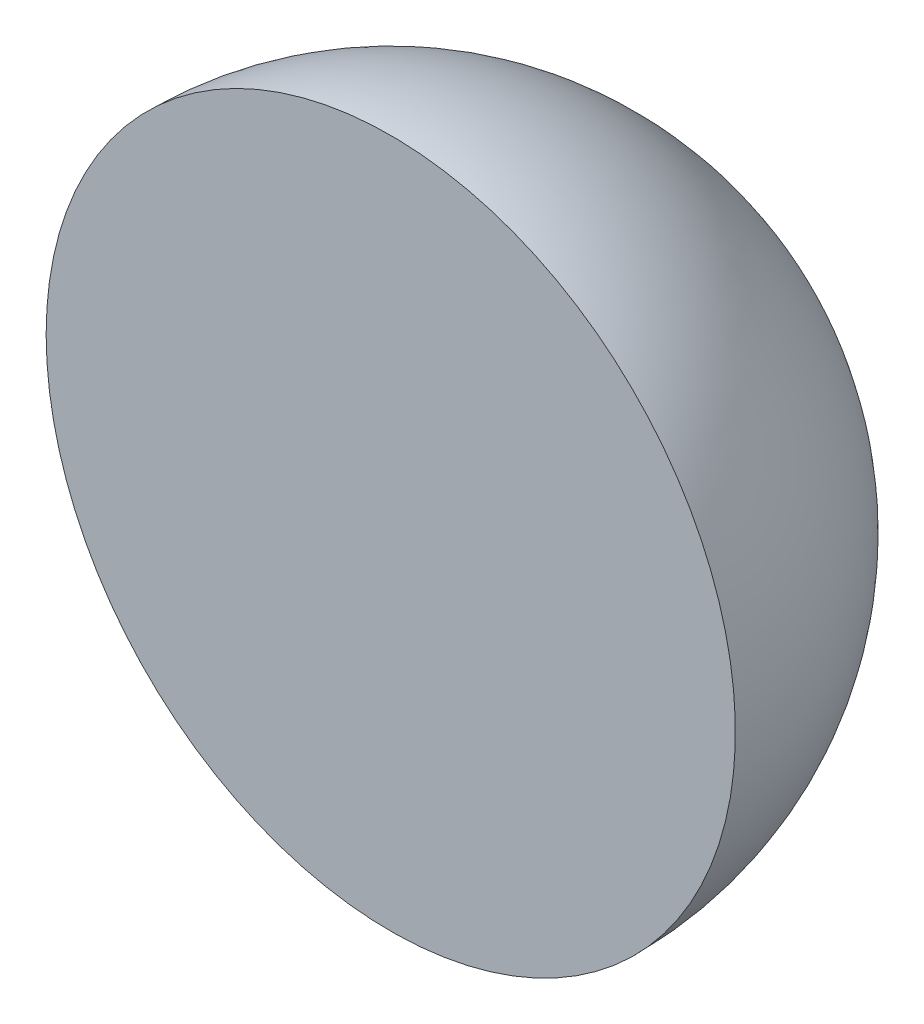
ISO-10303-21;
HEADER;
FILE_DESCRIPTION(('STEP AP214'),'2;1');
FILE_NAME('part.step','',(''),(''),'','','');
FILE_SCHEMA(('AUTOMOTIVE_DESIGN { 1 0 10303 214 1 1 1 1 }'));
ENDSEC;
DATA;
#1=APPLICATION_CONTEXT('core data for automotive mechanical design processes');
#2=APPLICATION_PROTOCOL_DEFINITION('international standard','automotive_design',2000,#1);
#3=PRODUCT_CONTEXT('',#1,'mechanical');
#4=PRODUCT('Part','Part','',(#3));
#5=PRODUCT_RELATED_PRODUCT_CATEGORY('part','',(#4));
#6=PRODUCT_DEFINITION_FORMATION('','',#4);
#7=PRODUCT_DEFINITION_CONTEXT('part definition',#1,'design');
#8=PRODUCT_DEFINITION('design','',#6,#7);
#9=PRODUCT_DEFINITION_SHAPE('','',#8);
#10=(LENGTH_UNIT() NAMED_UNIT(*) SI_UNIT(.MILLI.,.METRE.));
#11=(NAMED_UNIT(*) PLANE_ANGLE_UNIT() SI_UNIT($,.RADIAN.));
#12=(NAMED_UNIT(*) SI_UNIT($,.STERADIAN.) SOLID_ANGLE_UNIT());
#13=UNCERTAINTY_MEASURE_WITH_UNIT(LENGTH_MEASURE(1.E-05),#10,'distance_accuracy_value','');
#14=(GEOMETRIC_REPRESENTATION_CONTEXT(3) GLOBAL_UNCERTAINTY_ASSIGNED_CONTEXT((#13)) GLOBAL_UNIT_ASSIGNED_CONTEXT((#10,
#11,#12)) REPRESENTATION_CONTEXT('',''));
#15=CARTESIAN_POINT('',(0.,0.,0.));
#16=DIRECTION('',(0.,0.,1.));
#17=DIRECTION('',(1.,0.,0.));
#18=AXIS2_PLACEMENT_3D('',#15,#16,#17);
#19=CARTESIAN_POINT('',(0.,0.,0.));
#20=DIRECTION('',(0.,-1.,0.));
#21=DIRECTION('',(1.,0.,0.));
#22=AXIS2_PLACEMENT_3D('',#19,#20,#21);
#23=SPHERICAL_SURFACE('',#22,62.5);
#24=CARTESIAN_POINT('',(0.,0.,0.));
#25=DIRECTION('',(0.,0.,-1.));
#26=DIRECTION('',(-1.,0.,0.));
#27=AXIS2_PLACEMENT_3D('',#24,#25,#26);
#28=SPHERICAL_SURFACE('',#27,62.5);
#29=CARTESIAN_POINT('',(0.,0.,0.));
#30=DIRECTION('',(0.,0.,-1.));
#31=DIRECTION('',(-1.,0.,0.));
#32=AXIS2_PLACEMENT_3D('',#29,#30,#31);
#33=CIRCLE('',#32,62.5);
#34=CARTESIAN_POINT('',(-62.5,0.,4.36435167355392E-13));
#35=VERTEX_POINT('',#34);
#36=EDGE_CURVE('E10',#35,#35,#33,.T.);
#37=ORIENTED_EDGE('',*,*,#36,.T.);
#38=EDGE_LOOP('',(#37));
#39=FACE_BOUND('',#38,.T.);
#40=ADVANCED_FACE('F31',(#39),#28,.T.);
#41=CARTESIAN_POINT('',(0.,0.,0.));
#42=DIRECTION('',(0.,0.,-1.));
#43=DIRECTION('',(-1.,0.,0.));
#44=AXIS2_PLACEMENT_3D('',#41,#42,#43);
#45=PLANE('',#44);
#46=ORIENTED_EDGE('',*,*,#36,.F.);
#47=EDGE_LOOP('',(#46));
#48=FACE_BOUND('',#47,.T.);
#49=ADVANCED_FACE('F39',(#48),#45,.F.);
#50=CLOSED_SHELL('',(#40,#49));
#51=MANIFOLD_SOLID_BREP('B2',#50);
#52=ADVANCED_BREP_SHAPE_REPRESENTATION('',(#18,#51),#14);
#53=SHAPE_DEFINITION_REPRESENTATION(#9,#52);
ENDSEC;
END-ISO-10303-21;
